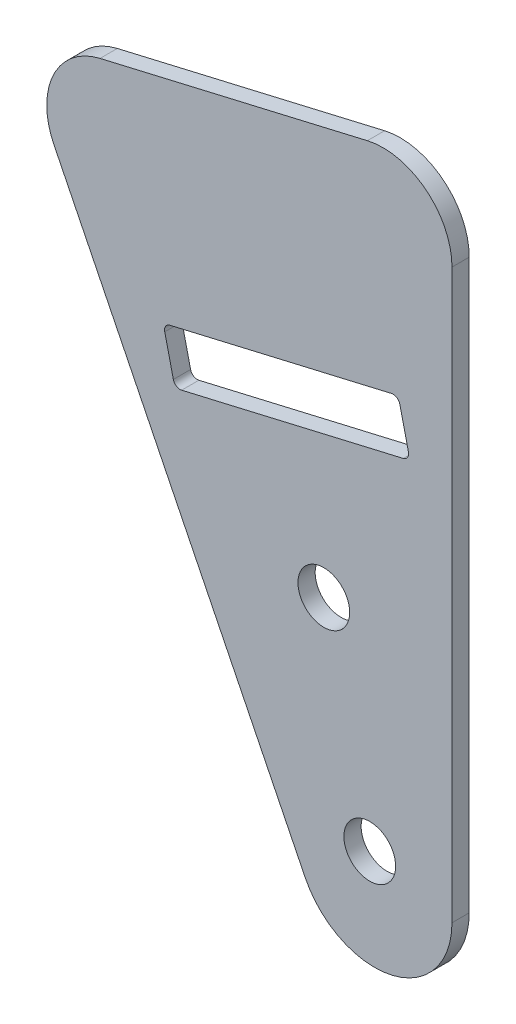
ISO-10303-21;
HEADER;
FILE_DESCRIPTION(('STEP AP214'),'2;1');
FILE_NAME('part.step','',(''),(''),'','','');
FILE_SCHEMA(('AUTOMOTIVE_DESIGN { 1 0 10303 214 1 1 1 1 }'));
ENDSEC;
DATA;
#1=APPLICATION_CONTEXT('core data for automotive mechanical design processes');
#2=APPLICATION_PROTOCOL_DEFINITION('international standard','automotive_design',2000,#1);
#3=PRODUCT_CONTEXT('',#1,'mechanical');
#4=PRODUCT('Part','Part','',(#3));
#5=PRODUCT_RELATED_PRODUCT_CATEGORY('part','',(#4));
#6=PRODUCT_DEFINITION_FORMATION('','',#4);
#7=PRODUCT_DEFINITION_CONTEXT('part definition',#1,'design');
#8=PRODUCT_DEFINITION('design','',#6,#7);
#9=PRODUCT_DEFINITION_SHAPE('','',#8);
#10=(LENGTH_UNIT() NAMED_UNIT(*) SI_UNIT(.MILLI.,.METRE.));
#11=(NAMED_UNIT(*) PLANE_ANGLE_UNIT() SI_UNIT($,.RADIAN.));
#12=(NAMED_UNIT(*) SI_UNIT($,.STERADIAN.) SOLID_ANGLE_UNIT());
#13=UNCERTAINTY_MEASURE_WITH_UNIT(LENGTH_MEASURE(1.E-05),#10,'distance_accuracy_value','');
#14=(GEOMETRIC_REPRESENTATION_CONTEXT(3) GLOBAL_UNCERTAINTY_ASSIGNED_CONTEXT((#13)) GLOBAL_UNIT_ASSIGNED_CONTEXT((#10,
#11,#12)) REPRESENTATION_CONTEXT('',''));
#15=CARTESIAN_POINT('',(0.,0.,0.));
#16=DIRECTION('',(0.,0.,1.));
#17=DIRECTION('',(1.,0.,0.));
#18=AXIS2_PLACEMENT_3D('',#15,#16,#17);
#19=CARTESIAN_POINT('',(227.921112781649,112.491099827656,3.175));
#20=DIRECTION('',(0.896727791564425,0.442582498338998,0.));
#21=DIRECTION('',(-0.442582498338998,0.896727791564425,0.));
#22=AXIS2_PLACEMENT_3D('',#19,#20,#21);
#23=PLANE('',#22);
#24=DIRECTION('',(0.442582498338998,-0.896727791564425,0.));
#25=VECTOR('',#24,1.);
#26=CARTESIAN_POINT('',(227.921112781649,112.491099827656,0.));
#27=LINE('',#26,#25);
#28=CARTESIAN_POINT('',(-85.640420596658,747.806193400365,0.));
#29=VERTEX_POINT('',#28);
#30=CARTESIAN_POINT('',(-39.3635980275474,654.043532068846,0.));
#31=VERTEX_POINT('',#30);
#32=EDGE_CURVE('E161',#29,#31,#27,.T.);
#33=ORIENTED_EDGE('',*,*,#32,.T.);
#34=DIRECTION('',(0.,0.,-1.));
#35=VECTOR('',#34,1.);
#36=CARTESIAN_POINT('',(-39.3635980275474,654.043532068846,3.175));
#37=LINE('',#36,#35);
#38=CARTESIAN_POINT('',(-39.3635980275474,654.043532068846,3.175));
#39=VERTEX_POINT('',#38);
#40=EDGE_CURVE('E142',#39,#31,#37,.T.);
#41=ORIENTED_EDGE('',*,*,#40,.F.);
#42=DIRECTION('',(0.442582498338998,-0.896727791564425,0.));
#43=VECTOR('',#42,1.);
#44=CARTESIAN_POINT('',(227.921112781649,112.491099827656,3.175));
#45=LINE('',#44,#43);
#46=CARTESIAN_POINT('',(-85.640420596658,747.806193400365,3.175));
#47=VERTEX_POINT('',#46);
#48=EDGE_CURVE('E149',#47,#39,#45,.T.);
#49=ORIENTED_EDGE('',*,*,#48,.F.);
#50=DIRECTION('',(0.,0.,-1.));
#51=VECTOR('',#50,1.);
#52=CARTESIAN_POINT('',(-85.640420596658,747.806193400365,3.175));
#53=LINE('',#52,#51);
#54=EDGE_CURVE('E239',#47,#29,#53,.T.);
#55=ORIENTED_EDGE('',*,*,#54,.T.);
#56=EDGE_LOOP('',(#33,#41,#49,#55));
#57=FACE_BOUND('',#56,.T.);
#58=ADVANCED_FACE('F35',(#57),#23,.F.);
#59=CARTESIAN_POINT('',(-26.5843130148651,660.350783768976,3.175));
#60=DIRECTION('',(0.,0.,-1.));
#61=DIRECTION('',(-1.,0.,0.));
#62=AXIS2_PLACEMENT_3D('',#59,#60,#61);
#63=CYLINDRICAL_SURFACE('',#62,14.2510192422917);
#64=CARTESIAN_POINT('',(-26.5843130148651,660.350783768976,0.));
#65=DIRECTION('',(0.,0.,1.));
#66=DIRECTION('',(1.,0.,0.));
#67=AXIS2_PLACEMENT_3D('',#64,#65,#66);
#68=CIRCLE('',#67,14.2510192422917);
#69=CARTESIAN_POINT('',(-12.3332937725734,660.350783768976,0.));
#70=VERTEX_POINT('',#69);
#71=EDGE_CURVE('E255',#31,#70,#68,.T.);
#72=ORIENTED_EDGE('',*,*,#71,.T.);
#73=DIRECTION('',(0.,0.,-1.));
#74=VECTOR('',#73,1.);
#75=CARTESIAN_POINT('',(-12.3332937725734,660.350783768976,3.175));
#76=LINE('',#75,#74);
#77=CARTESIAN_POINT('',(-12.3332937725734,660.350783768976,3.175));
#78=VERTEX_POINT('',#77);
#79=EDGE_CURVE('E144',#78,#70,#76,.T.);
#80=ORIENTED_EDGE('',*,*,#79,.F.);
#81=CARTESIAN_POINT('',(-26.5843130148651,660.350783768976,3.175));
#82=DIRECTION('',(0.,0.,1.));
#83=DIRECTION('',(1.,0.,0.));
#84=AXIS2_PLACEMENT_3D('',#81,#82,#83);
#85=CIRCLE('',#84,14.2510192422917);
#86=EDGE_CURVE('E137',#39,#78,#85,.T.);
#87=ORIENTED_EDGE('',*,*,#86,.F.);
#88=ORIENTED_EDGE('',*,*,#40,.T.);
#89=EDGE_LOOP('',(#72,#80,#87,#88));
#90=FACE_BOUND('',#89,.T.);
#91=ADVANCED_FACE('F140',(#90),#63,.T.);
#92=CARTESIAN_POINT('',(-12.3332937725735,0.,3.175));
#93=DIRECTION('',(1.,0.,0.));
#94=DIRECTION('',(0.,1.,0.));
#95=AXIS2_PLACEMENT_3D('',#92,#93,#94);
#96=PLANE('',#95);
#97=DIRECTION('',(0.,-1.,0.));
#98=VECTOR('',#97,1.);
#99=CARTESIAN_POINT('',(-12.3332937725735,0.,0.));
#100=LINE('',#99,#98);
#101=CARTESIAN_POINT('',(-12.3332937725734,764.911679743821,0.));
#102=VERTEX_POINT('',#101);
#103=EDGE_CURVE('E257',#102,#70,#100,.T.);
#104=ORIENTED_EDGE('',*,*,#103,.F.);
#105=DIRECTION('',(0.,0.,-1.));
#106=VECTOR('',#105,1.);
#107=CARTESIAN_POINT('',(-12.3332937725734,764.911679743821,3.175));
#108=LINE('',#107,#106);
#109=CARTESIAN_POINT('',(-12.3332937725734,764.911679743821,3.175));
#110=VERTEX_POINT('',#109);
#111=EDGE_CURVE('E166',#110,#102,#108,.T.);
#112=ORIENTED_EDGE('',*,*,#111,.F.);
#113=DIRECTION('',(0.,-1.,0.));
#114=VECTOR('',#113,1.);
#115=CARTESIAN_POINT('',(-12.3332937725735,0.,3.175));
#116=LINE('',#115,#114);
#117=EDGE_CURVE('E148',#110,#78,#116,.T.);
#118=ORIENTED_EDGE('',*,*,#117,.T.);
#119=ORIENTED_EDGE('',*,*,#79,.T.);
#120=EDGE_LOOP('',(#104,#112,#118,#119));
#121=FACE_BOUND('',#120,.T.);
#122=ADVANCED_FACE('F281',(#121),#96,.T.);
#123=CARTESIAN_POINT('',(-25.0332937725734,764.911679743821,3.175));
#124=DIRECTION('',(0.,0.,-1.));
#125=DIRECTION('',(-1.,0.,0.));
#126=AXIS2_PLACEMENT_3D('',#123,#124,#125);
#127=CYLINDRICAL_SURFACE('',#126,12.7);
#128=CARTESIAN_POINT('',(-25.0332937725734,764.911679743821,0.));
#129=DIRECTION('',(0.,0.,1.));
#130=DIRECTION('',(1.,0.,0.));
#131=AXIS2_PLACEMENT_3D('',#128,#129,#130);
#132=CIRCLE('',#131,12.7);
#133=CARTESIAN_POINT('',(-27.9191883044797,777.279444810748,0.));
#134=VERTEX_POINT('',#133);
#135=EDGE_CURVE('E260',#102,#134,#132,.T.);
#136=ORIENTED_EDGE('',*,*,#135,.T.);
#137=DIRECTION('',(0.,0.,-1.));
#138=VECTOR('',#137,1.);
#139=CARTESIAN_POINT('',(-27.9191883044797,777.279444810748,3.175));
#140=LINE('',#139,#138);
#141=CARTESIAN_POINT('',(-27.9191883044797,777.279444810748,3.175));
#142=VERTEX_POINT('',#141);
#143=EDGE_CURVE('E269',#142,#134,#140,.T.);
#144=ORIENTED_EDGE('',*,*,#143,.F.);
#145=CARTESIAN_POINT('',(-25.0332937725734,764.911679743821,3.175));
#146=DIRECTION('',(0.,0.,1.));
#147=DIRECTION('',(1.,0.,0.));
#148=AXIS2_PLACEMENT_3D('',#145,#146,#147);
#149=CIRCLE('',#148,12.7);
#150=EDGE_CURVE('E235',#110,#142,#149,.T.);
#151=ORIENTED_EDGE('',*,*,#150,.F.);
#152=ORIENTED_EDGE('',*,*,#111,.T.);
#153=EDGE_LOOP('',(#136,#144,#151,#152));
#154=FACE_BOUND('',#153,.T.);
#155=ADVANCED_FACE('F274',(#154),#127,.T.);
#156=CARTESIAN_POINT('',(-173.446777412911,743.322034447853,3.175));
#157=DIRECTION('',(0.227235789913885,-0.973839769049412,0.));
#158=DIRECTION('',(0.973839769049412,0.227235789913885,0.));
#159=AXIS2_PLACEMENT_3D('',#156,#157,#158);
#160=PLANE('',#159);
#161=DIRECTION('',(-0.973839769049412,-0.227235789913885,0.));
#162=VECTOR('',#161,1.);
#163=CARTESIAN_POINT('',(-173.446777412911,743.322034447853,0.));
#164=LINE('',#163,#162);
#165=CARTESIAN_POINT('',(-77.1378721756962,765.794756196198,0.));
#166=VERTEX_POINT('',#165);
#167=EDGE_CURVE('E262',#134,#166,#164,.T.);
#168=ORIENTED_EDGE('',*,*,#167,.T.);
#169=DIRECTION('',(0.,0.,-1.));
#170=VECTOR('',#169,1.);
#171=CARTESIAN_POINT('',(-77.1378721756962,765.794756196198,3.175));
#172=LINE('',#171,#170);
#173=CARTESIAN_POINT('',(-77.1378721756962,765.794756196198,3.175));
#174=VERTEX_POINT('',#173);
#175=EDGE_CURVE('E266',#174,#166,#172,.T.);
#176=ORIENTED_EDGE('',*,*,#175,.F.);
#177=DIRECTION('',(-0.973839769049412,-0.227235789913885,0.));
#178=VECTOR('',#177,1.);
#179=CARTESIAN_POINT('',(-173.446777412911,743.322034447853,3.175));
#180=LINE('',#179,#178);
#181=EDGE_CURVE('E237',#142,#174,#180,.T.);
#182=ORIENTED_EDGE('',*,*,#181,.F.);
#183=ORIENTED_EDGE('',*,*,#143,.T.);
#184=EDGE_LOOP('',(#168,#176,#182,#183));
#185=FACE_BOUND('',#184,.T.);
#186=ADVANCED_FACE('F287',(#185),#160,.F.);
#187=CARTESIAN_POINT('',(-162.624672918258,696.942915446877,3.175));
#188=DIRECTION('',(-0.227235789913879,0.973839769049414,0.));
#189=DIRECTION('',(-0.973839769049414,-0.227235789913879,0.));
#190=AXIS2_PLACEMENT_3D('',#187,#188,#189);
#191=PLANE('',#190);
#192=DIRECTION('',(0.973839769049414,0.227235789913879,0.));
#193=VECTOR('',#192,1.);
#194=CARTESIAN_POINT('',(-162.624672918258,696.942915446877,3.175));
#195=LINE('',#194,#193);
#196=CARTESIAN_POINT('',(-62.1132381058697,720.396255524849,3.175));
#197=VERTEX_POINT('',#196);
#198=CARTESIAN_POINT('',(-21.2996133850087,729.91970748014,3.175));
#199=VERTEX_POINT('',#198);
#200=EDGE_CURVE('E215',#197,#199,#195,.T.);
#201=ORIENTED_EDGE('',*,*,#200,.T.);
#202=DIRECTION('',(0.,0.,-1.));
#203=VECTOR('',#202,1.);
#204=CARTESIAN_POINT('',(-21.2996133850087,729.91970748014,0.));
#205=LINE('',#204,#203);
#206=CARTESIAN_POINT('',(-21.2996133850087,729.91970748014,0.));
#207=VERTEX_POINT('',#206);
#208=EDGE_CURVE('E183',#199,#207,#205,.T.);
#209=ORIENTED_EDGE('',*,*,#208,.T.);
#210=DIRECTION('',(0.973839769049414,0.227235789913879,0.));
#211=VECTOR('',#210,1.);
#212=CARTESIAN_POINT('',(-162.624672918258,696.942915446877,0.));
#213=LINE('',#212,#211);
#214=CARTESIAN_POINT('',(-62.1132381058697,720.396255524849,0.));
#215=VERTEX_POINT('',#214);
#216=EDGE_CURVE('E201',#215,#207,#213,.T.);
#217=ORIENTED_EDGE('',*,*,#216,.F.);
#218=DIRECTION('',(0.,0.,-1.));
#219=VECTOR('',#218,1.);
#220=CARTESIAN_POINT('',(-62.1132381058697,720.396255524849,3.175));
#221=LINE('',#220,#219);
#222=EDGE_CURVE('E57',#215,#197,#221,.F.);
#223=ORIENTED_EDGE('',*,*,#222,.T.);
#224=EDGE_LOOP('',(#201,#209,#217,#223));
#225=FACE_BOUND('',#224,.T.);
#226=ADVANCED_FACE('F206',(#225),#191,.T.);
#227=CARTESIAN_POINT('',(99.2746583057013,23.1647506247844,3.175));
#228=DIRECTION('',(-0.973839769049412,-0.227235789913887,0.));
#229=DIRECTION('',(0.227235789913887,-0.973839769049412,0.));
#230=AXIS2_PLACEMENT_3D('',#227,#228,#229);
#231=PLANE('',#230);
#232=DIRECTION('',(-0.227235789913887,0.973839769049412,0.));
#233=VECTOR('',#232,1.);
#234=CARTESIAN_POINT('',(99.2746583057013,23.1647506247844,0.));
#235=LINE('',#234,#233);
#236=CARTESIAN_POINT('',(-63.6386040657531,721.344442578352,0.));
#237=VERTEX_POINT('',#236);
#238=CARTESIAN_POINT('',(-65.2258460583015,728.146713365161,0.));
#239=VERTEX_POINT('',#238);
#240=EDGE_CURVE('E203',#237,#239,#235,.T.);
#241=ORIENTED_EDGE('',*,*,#240,.T.);
#242=DIRECTION('',(0.,0.,-1.));
#243=VECTOR('',#242,1.);
#244=CARTESIAN_POINT('',(-65.2258460583015,728.146713365161,3.175));
#245=LINE('',#244,#243);
#246=CARTESIAN_POINT('',(-65.2258460583015,728.146713365161,3.175));
#247=VERTEX_POINT('',#246);
#248=EDGE_CURVE('E180',#239,#247,#245,.F.);
#249=ORIENTED_EDGE('',*,*,#248,.T.);
#250=DIRECTION('',(-0.227235789913887,0.973839769049412,0.));
#251=VECTOR('',#250,1.);
#252=CARTESIAN_POINT('',(99.2746583057013,23.1647506247844,3.175));
#253=LINE('',#252,#251);
#254=CARTESIAN_POINT('',(-63.6386040657531,721.344442578352,3.175));
#255=VERTEX_POINT('',#254);
#256=EDGE_CURVE('E213',#255,#247,#253,.T.);
#257=ORIENTED_EDGE('',*,*,#256,.F.);
#258=DIRECTION('',(0.,0.,-1.));
#259=VECTOR('',#258,1.);
#260=CARTESIAN_POINT('',(-63.6386040657531,721.344442578352,3.175));
#261=LINE('',#260,#259);
#262=EDGE_CURVE('E177',#255,#237,#261,.T.);
#263=ORIENTED_EDGE('',*,*,#262,.T.);
#264=EDGE_LOOP('',(#241,#249,#257,#263));
#265=FACE_BOUND('',#264,.T.);
#266=ADVANCED_FACE('F217',(#265),#231,.F.);
#267=CARTESIAN_POINT('',(-164.789093817192,706.21873924707,3.175));
#268=DIRECTION('',(-0.227235789913886,0.973839769049412,0.));
#269=DIRECTION('',(-0.973839769049412,-0.227235789913886,0.));
#270=AXIS2_PLACEMENT_3D('',#267,#268,#269);
#271=PLANE('',#270);
#272=DIRECTION('',(0.973839769049412,0.227235789913886,0.));
#273=VECTOR('',#272,1.);
#274=CARTESIAN_POINT('',(-164.789093817192,706.21873924707,0.));
#275=LINE('',#274,#273);
#276=CARTESIAN_POINT('',(-64.2776590047994,729.672079325045,0.));
#277=VERTEX_POINT('',#276);
#278=CARTESIAN_POINT('',(-23.4640342839384,739.195531280336,0.));
#279=VERTEX_POINT('',#278);
#280=EDGE_CURVE('E242',#277,#279,#275,.T.);
#281=ORIENTED_EDGE('',*,*,#280,.T.);
#282=DIRECTION('',(0.,0.,-1.));
#283=VECTOR('',#282,1.);
#284=CARTESIAN_POINT('',(-23.4640342839384,739.195531280336,3.175));
#285=LINE('',#284,#283);
#286=CARTESIAN_POINT('',(-23.4640342839384,739.195531280336,3.175));
#287=VERTEX_POINT('',#286);
#288=EDGE_CURVE('E175',#279,#287,#285,.F.);
#289=ORIENTED_EDGE('',*,*,#288,.T.);
#290=DIRECTION('',(0.973839769049412,0.227235789913886,0.));
#291=VECTOR('',#290,1.);
#292=CARTESIAN_POINT('',(-164.789093817192,706.21873924707,3.175));
#293=LINE('',#292,#291);
#294=CARTESIAN_POINT('',(-64.2776590047994,729.672079325045,3.175));
#295=VERTEX_POINT('',#294);
#296=EDGE_CURVE('E219',#295,#287,#293,.T.);
#297=ORIENTED_EDGE('',*,*,#296,.F.);
#298=DIRECTION('',(0.,0.,-1.));
#299=VECTOR('',#298,1.);
#300=CARTESIAN_POINT('',(-64.2776590047994,729.672079325045,0.));
#301=LINE('',#300,#299);
#302=EDGE_CURVE('E172',#295,#277,#301,.T.);
#303=ORIENTED_EDGE('',*,*,#302,.T.);
#304=EDGE_LOOP('',(#281,#289,#297,#303));
#305=FACE_BOUND('',#304,.T.);
#306=ADVANCED_FACE('F309',(#305),#271,.F.);
#307=CARTESIAN_POINT('',(-27.475367191438,664.169477971386,3.175));
#308=DIRECTION('',(0.,0.,-1.));
#309=DIRECTION('',(-1.,0.,0.));
#310=AXIS2_PLACEMENT_3D('',#307,#308,#309);
#311=CYLINDRICAL_SURFACE('',#310,4.76250000000002);
#312=CARTESIAN_POINT('',(-27.475367191438,664.169477971386,3.175));
#313=DIRECTION('',(0.,0.,1.));
#314=DIRECTION('',(1.,0.,0.));
#315=AXIS2_PLACEMENT_3D('',#312,#313,#314);
#316=CIRCLE('',#315,4.76250000000002);
#317=CARTESIAN_POINT('',(-22.712867191438,664.169477971386,3.175));
#318=VERTEX_POINT('',#317);
#319=EDGE_CURVE('E158',#318,#318,#316,.T.);
#320=ORIENTED_EDGE('',*,*,#319,.T.);
#321=EDGE_LOOP('',(#320));
#322=FACE_BOUND('',#321,.T.);
#323=CARTESIAN_POINT('',(-27.475367191438,664.169477971386,0.));
#324=DIRECTION('',(0.,0.,1.));
#325=DIRECTION('',(1.,0.,0.));
#326=AXIS2_PLACEMENT_3D('',#323,#324,#325);
#327=CIRCLE('',#326,4.76250000000002);
#328=CARTESIAN_POINT('',(-22.712867191438,664.169477971386,0.));
#329=VERTEX_POINT('',#328);
#330=EDGE_CURVE('E251',#329,#329,#327,.T.);
#331=ORIENTED_EDGE('',*,*,#330,.F.);
#332=EDGE_LOOP('',(#331));
#333=FACE_BOUND('',#332,.T.);
#334=ADVANCED_FACE('F305',(#322,#333),#311,.F.);
#335=CARTESIAN_POINT('',(-35.9346366816266,700.422451368639,3.175));
#336=DIRECTION('',(0.,0.,-1.));
#337=DIRECTION('',(-1.,0.,0.));
#338=AXIS2_PLACEMENT_3D('',#335,#336,#337);
#339=CYLINDRICAL_SURFACE('',#338,4.76250000000012);
#340=CARTESIAN_POINT('',(-35.9346366816266,700.422451368639,3.175));
#341=DIRECTION('',(0.,0.,1.));
#342=DIRECTION('',(1.,0.,0.));
#343=AXIS2_PLACEMENT_3D('',#340,#341,#342);
#344=CIRCLE('',#343,4.76250000000012);
#345=CARTESIAN_POINT('',(-31.1721366816264,700.422451368639,3.175));
#346=VERTEX_POINT('',#345);
#347=EDGE_CURVE('E229',#346,#346,#344,.T.);
#348=ORIENTED_EDGE('',*,*,#347,.T.);
#349=EDGE_LOOP('',(#348));
#350=FACE_BOUND('',#349,.T.);
#351=CARTESIAN_POINT('',(-35.9346366816266,700.422451368639,0.));
#352=DIRECTION('',(0.,0.,1.));
#353=DIRECTION('',(1.,0.,0.));
#354=AXIS2_PLACEMENT_3D('',#351,#352,#353);
#355=CIRCLE('',#354,4.76250000000012);
#356=CARTESIAN_POINT('',(-31.1721366816264,700.422451368639,0.));
#357=VERTEX_POINT('',#356);
#358=EDGE_CURVE('E248',#357,#357,#355,.T.);
#359=ORIENTED_EDGE('',*,*,#358,.F.);
#360=EDGE_LOOP('',(#359));
#361=FACE_BOUND('',#360,.T.);
#362=ADVANCED_FACE('F308',(#350,#361),#339,.F.);
#363=CARTESIAN_POINT('',(142.56183603994,33.265381486453,3.175));
#364=DIRECTION('',(-0.973839769049415,-0.227235789913875,0.));
#365=DIRECTION('',(0.227235789913875,-0.973839769049415,0.));
#366=AXIS2_PLACEMENT_3D('',#363,#364,#365);
#367=PLANE('',#366);
#368=DIRECTION('',(-0.227235789913875,0.973839769049415,0.));
#369=VECTOR('',#368,1.);
#370=CARTESIAN_POINT('',(142.56183603994,33.265381486453,3.175));
#371=LINE('',#370,#369);
#372=CARTESIAN_POINT('',(-20.3514263315066,731.445073440024,3.175));
#373=VERTEX_POINT('',#372);
#374=CARTESIAN_POINT('',(-21.938668324055,738.247344226834,3.175));
#375=VERTEX_POINT('',#374);
#376=EDGE_CURVE('E222',#373,#375,#371,.T.);
#377=ORIENTED_EDGE('',*,*,#376,.T.);
#378=DIRECTION('',(0.,0.,-1.));
#379=VECTOR('',#378,1.);
#380=CARTESIAN_POINT('',(-21.938668324055,738.247344226834,3.175));
#381=LINE('',#380,#379);
#382=CARTESIAN_POINT('',(-21.938668324055,738.247344226834,0.));
#383=VERTEX_POINT('',#382);
#384=EDGE_CURVE('E164',#375,#383,#381,.T.);
#385=ORIENTED_EDGE('',*,*,#384,.T.);
#386=DIRECTION('',(-0.227235789913875,0.973839769049415,0.));
#387=VECTOR('',#386,1.);
#388=CARTESIAN_POINT('',(142.56183603994,33.265381486453,0.));
#389=LINE('',#388,#387);
#390=CARTESIAN_POINT('',(-20.3514263315066,731.445073440024,0.));
#391=VERTEX_POINT('',#390);
#392=EDGE_CURVE('E245',#391,#383,#389,.T.);
#393=ORIENTED_EDGE('',*,*,#392,.F.);
#394=DIRECTION('',(0.,0.,-1.));
#395=VECTOR('',#394,1.);
#396=CARTESIAN_POINT('',(-20.3514263315066,731.445073440024,3.175));
#397=LINE('',#396,#395);
#398=EDGE_CURVE('E162',#391,#373,#397,.F.);
#399=ORIENTED_EDGE('',*,*,#398,.T.);
#400=EDGE_LOOP('',(#377,#385,#393,#399));
#401=FACE_BOUND('',#400,.T.);
#402=ADVANCED_FACE('F313',(#401),#367,.T.);
#403=CARTESIAN_POINT('',(-74.2519776437898,753.426991129271,3.175));
#404=DIRECTION('',(0.,0.,-1.));
#405=DIRECTION('',(-1.,0.,0.));
#406=AXIS2_PLACEMENT_3D('',#403,#404,#405);
#407=CYLINDRICAL_SURFACE('',#406,12.7);
#408=CARTESIAN_POINT('',(-74.2519776437898,753.426991129271,0.));
#409=DIRECTION('',(0.,0.,1.));
#410=DIRECTION('',(1.,0.,0.));
#411=AXIS2_PLACEMENT_3D('',#408,#409,#410);
#412=CIRCLE('',#411,12.7);
#413=EDGE_CURVE('E224',#166,#29,#412,.T.);
#414=ORIENTED_EDGE('',*,*,#413,.T.);
#415=ORIENTED_EDGE('',*,*,#54,.F.);
#416=CARTESIAN_POINT('',(-74.2519776437898,753.426991129271,3.175));
#417=DIRECTION('',(0.,0.,1.));
#418=DIRECTION('',(1.,0.,0.));
#419=AXIS2_PLACEMENT_3D('',#416,#417,#418);
#420=CIRCLE('',#419,12.7);
#421=EDGE_CURVE('E154',#174,#47,#420,.T.);
#422=ORIENTED_EDGE('',*,*,#421,.F.);
#423=ORIENTED_EDGE('',*,*,#175,.T.);
#424=EDGE_LOOP('',(#414,#415,#422,#423));
#425=FACE_BOUND('',#424,.T.);
#426=ADVANCED_FACE('F283',(#425),#407,.T.);
#427=CARTESIAN_POINT('',(0.,0.,3.175));
#428=DIRECTION('',(0.,0.,1.));
#429=DIRECTION('',(1.,0.,0.));
#430=AXIS2_PLACEMENT_3D('',#427,#428,#429);
#431=PLANE('',#430);
#432=ORIENTED_EDGE('',*,*,#200,.F.);
#433=CARTESIAN_POINT('',(-62.4018275590603,721.633032031542,3.175));
#434=DIRECTION('',(0.,0.,1.));
#435=DIRECTION('',(1.,0.,0.));
#436=AXIS2_PLACEMENT_3D('',#433,#434,#435);
#437=CIRCLE('',#436,1.27);
#438=EDGE_CURVE('E11',#197,#255,#437,.F.);
#439=ORIENTED_EDGE('',*,*,#438,.T.);
#440=ORIENTED_EDGE('',*,*,#256,.T.);
#441=CARTESIAN_POINT('',(-63.9890695516088,728.435302818352,3.175));
#442=DIRECTION('',(0.,0.,1.));
#443=DIRECTION('',(1.,0.,0.));
#444=AXIS2_PLACEMENT_3D('',#441,#442,#443);
#445=CIRCLE('',#444,1.27);
#446=EDGE_CURVE('E192',#247,#295,#445,.F.);
#447=ORIENTED_EDGE('',*,*,#446,.T.);
#448=ORIENTED_EDGE('',*,*,#296,.T.);
#449=CARTESIAN_POINT('',(-23.1754448307478,737.958754773643,3.175));
#450=DIRECTION('',(0.,0.,1.));
#451=DIRECTION('',(1.,0.,0.));
#452=AXIS2_PLACEMENT_3D('',#449,#450,#451);
#453=CIRCLE('',#452,1.27);
#454=EDGE_CURVE('E188',#287,#375,#453,.F.);
#455=ORIENTED_EDGE('',*,*,#454,.T.);
#456=ORIENTED_EDGE('',*,*,#376,.F.);
#457=CARTESIAN_POINT('',(-21.5882028381993,731.156483986833,3.175));
#458=DIRECTION('',(0.,0.,1.));
#459=DIRECTION('',(1.,0.,0.));
#460=AXIS2_PLACEMENT_3D('',#457,#458,#459);
#461=CIRCLE('',#460,1.27);
#462=EDGE_CURVE('E50',#373,#199,#461,.F.);
#463=ORIENTED_EDGE('',*,*,#462,.T.);
#464=EDGE_LOOP('',(#432,#439,#440,#447,#448,#455,#456,#463));
#465=FACE_BOUND('',#464,.T.);
#466=ORIENTED_EDGE('',*,*,#347,.F.);
#467=EDGE_LOOP('',(#466));
#468=FACE_BOUND('',#467,.T.);
#469=ORIENTED_EDGE('',*,*,#319,.F.);
#470=EDGE_LOOP('',(#469));
#471=FACE_BOUND('',#470,.T.);
#472=ORIENTED_EDGE('',*,*,#48,.T.);
#473=ORIENTED_EDGE('',*,*,#86,.T.);
#474=ORIENTED_EDGE('',*,*,#117,.F.);
#475=ORIENTED_EDGE('',*,*,#150,.T.);
#476=ORIENTED_EDGE('',*,*,#181,.T.);
#477=ORIENTED_EDGE('',*,*,#421,.T.);
#478=EDGE_LOOP('',(#472,#473,#474,#475,#476,#477));
#479=FACE_BOUND('',#478,.T.);
#480=ADVANCED_FACE('F152',(#465,#468,#471,#479),#431,.T.);
#481=CARTESIAN_POINT('',(0.,0.,0.));
#482=DIRECTION('',(0.,0.,1.));
#483=DIRECTION('',(1.,0.,0.));
#484=AXIS2_PLACEMENT_3D('',#481,#482,#483);
#485=PLANE('',#484);
#486=ORIENTED_EDGE('',*,*,#240,.F.);
#487=CARTESIAN_POINT('',(-62.4018275590603,721.633032031542,0.));
#488=DIRECTION('',(0.,0.,1.));
#489=DIRECTION('',(1.,0.,0.));
#490=AXIS2_PLACEMENT_3D('',#487,#488,#489);
#491=CIRCLE('',#490,1.27);
#492=EDGE_CURVE('E43',#237,#215,#491,.T.);
#493=ORIENTED_EDGE('',*,*,#492,.T.);
#494=ORIENTED_EDGE('',*,*,#216,.T.);
#495=CARTESIAN_POINT('',(-21.5882028381993,731.156483986833,0.));
#496=DIRECTION('',(0.,0.,1.));
#497=DIRECTION('',(1.,0.,0.));
#498=AXIS2_PLACEMENT_3D('',#495,#496,#497);
#499=CIRCLE('',#498,1.27);
#500=EDGE_CURVE('E194',#207,#391,#499,.T.);
#501=ORIENTED_EDGE('',*,*,#500,.T.);
#502=ORIENTED_EDGE('',*,*,#392,.T.);
#503=CARTESIAN_POINT('',(-23.1754448307478,737.958754773643,0.));
#504=DIRECTION('',(0.,0.,1.));
#505=DIRECTION('',(1.,0.,0.));
#506=AXIS2_PLACEMENT_3D('',#503,#504,#505);
#507=CIRCLE('',#506,1.27);
#508=EDGE_CURVE('E186',#383,#279,#507,.T.);
#509=ORIENTED_EDGE('',*,*,#508,.T.);
#510=ORIENTED_EDGE('',*,*,#280,.F.);
#511=CARTESIAN_POINT('',(-63.9890695516088,728.435302818352,0.));
#512=DIRECTION('',(0.,0.,1.));
#513=DIRECTION('',(1.,0.,0.));
#514=AXIS2_PLACEMENT_3D('',#511,#512,#513);
#515=CIRCLE('',#514,1.27);
#516=EDGE_CURVE('E190',#277,#239,#515,.T.);
#517=ORIENTED_EDGE('',*,*,#516,.T.);
#518=EDGE_LOOP('',(#486,#493,#494,#501,#502,#509,#510,#517));
#519=FACE_BOUND('',#518,.T.);
#520=ORIENTED_EDGE('',*,*,#358,.T.);
#521=EDGE_LOOP('',(#520));
#522=FACE_BOUND('',#521,.T.);
#523=ORIENTED_EDGE('',*,*,#330,.T.);
#524=EDGE_LOOP('',(#523));
#525=FACE_BOUND('',#524,.T.);
#526=ORIENTED_EDGE('',*,*,#32,.F.);
#527=ORIENTED_EDGE('',*,*,#413,.F.);
#528=ORIENTED_EDGE('',*,*,#167,.F.);
#529=ORIENTED_EDGE('',*,*,#135,.F.);
#530=ORIENTED_EDGE('',*,*,#103,.T.);
#531=ORIENTED_EDGE('',*,*,#71,.F.);
#532=EDGE_LOOP('',(#526,#527,#528,#529,#530,#531));
#533=FACE_BOUND('',#532,.T.);
#534=ADVANCED_FACE('F199',(#519,#522,#525,#533),#485,.F.);
#535=CARTESIAN_POINT('',(-23.1754448307478,737.958754773643,3.175));
#536=DIRECTION('',(0.,0.,-1.));
#537=DIRECTION('',(-1.,0.,0.));
#538=AXIS2_PLACEMENT_3D('',#535,#536,#537);
#539=CYLINDRICAL_SURFACE('',#538,1.27);
#540=ORIENTED_EDGE('',*,*,#454,.F.);
#541=ORIENTED_EDGE('',*,*,#288,.F.);
#542=ORIENTED_EDGE('',*,*,#508,.F.);
#543=ORIENTED_EDGE('',*,*,#384,.F.);
#544=EDGE_LOOP('',(#540,#541,#542,#543));
#545=FACE_BOUND('',#544,.T.);
#546=ADVANCED_FACE('F323',(#545),#539,.F.);
#547=CARTESIAN_POINT('',(-63.9890695516088,728.435302818352,3.175));
#548=DIRECTION('',(0.,0.,1.));
#549=DIRECTION('',(1.,0.,0.));
#550=AXIS2_PLACEMENT_3D('',#547,#548,#549);
#551=CYLINDRICAL_SURFACE('',#550,1.27);
#552=ORIENTED_EDGE('',*,*,#446,.F.);
#553=ORIENTED_EDGE('',*,*,#248,.F.);
#554=ORIENTED_EDGE('',*,*,#516,.F.);
#555=ORIENTED_EDGE('',*,*,#302,.F.);
#556=EDGE_LOOP('',(#552,#553,#554,#555));
#557=FACE_BOUND('',#556,.T.);
#558=ADVANCED_FACE('F326',(#557),#551,.F.);
#559=CARTESIAN_POINT('',(-21.5882028381993,731.156483986833,3.175));
#560=DIRECTION('',(0.,0.,1.));
#561=DIRECTION('',(1.,0.,0.));
#562=AXIS2_PLACEMENT_3D('',#559,#560,#561);
#563=CYLINDRICAL_SURFACE('',#562,1.27);
#564=ORIENTED_EDGE('',*,*,#462,.F.);
#565=ORIENTED_EDGE('',*,*,#398,.F.);
#566=ORIENTED_EDGE('',*,*,#500,.F.);
#567=ORIENTED_EDGE('',*,*,#208,.F.);
#568=EDGE_LOOP('',(#564,#565,#566,#567));
#569=FACE_BOUND('',#568,.T.);
#570=ADVANCED_FACE('F329',(#569),#563,.F.);
#571=CARTESIAN_POINT('',(-62.4018275590603,721.633032031542,3.175));
#572=DIRECTION('',(0.,0.,-1.));
#573=DIRECTION('',(-1.,0.,0.));
#574=AXIS2_PLACEMENT_3D('',#571,#572,#573);
#575=CYLINDRICAL_SURFACE('',#574,1.27);
#576=ORIENTED_EDGE('',*,*,#438,.F.);
#577=ORIENTED_EDGE('',*,*,#222,.F.);
#578=ORIENTED_EDGE('',*,*,#492,.F.);
#579=ORIENTED_EDGE('',*,*,#262,.F.);
#580=EDGE_LOOP('',(#576,#577,#578,#579));
#581=FACE_BOUND('',#580,.T.);
#582=ADVANCED_FACE('F37',(#581),#575,.F.);
#583=CLOSED_SHELL('',(#58,#91,#122,#155,#186,#226,#266,#306,#334,#362,#402,#426,#480,#534,#546,
#558,#570,#582));
#584=MANIFOLD_SOLID_BREP('B2',#583);
#585=ADVANCED_BREP_SHAPE_REPRESENTATION('',(#18,#584),#14);
#586=SHAPE_DEFINITION_REPRESENTATION(#9,#585);
ENDSEC;
END-ISO-10303-21;
